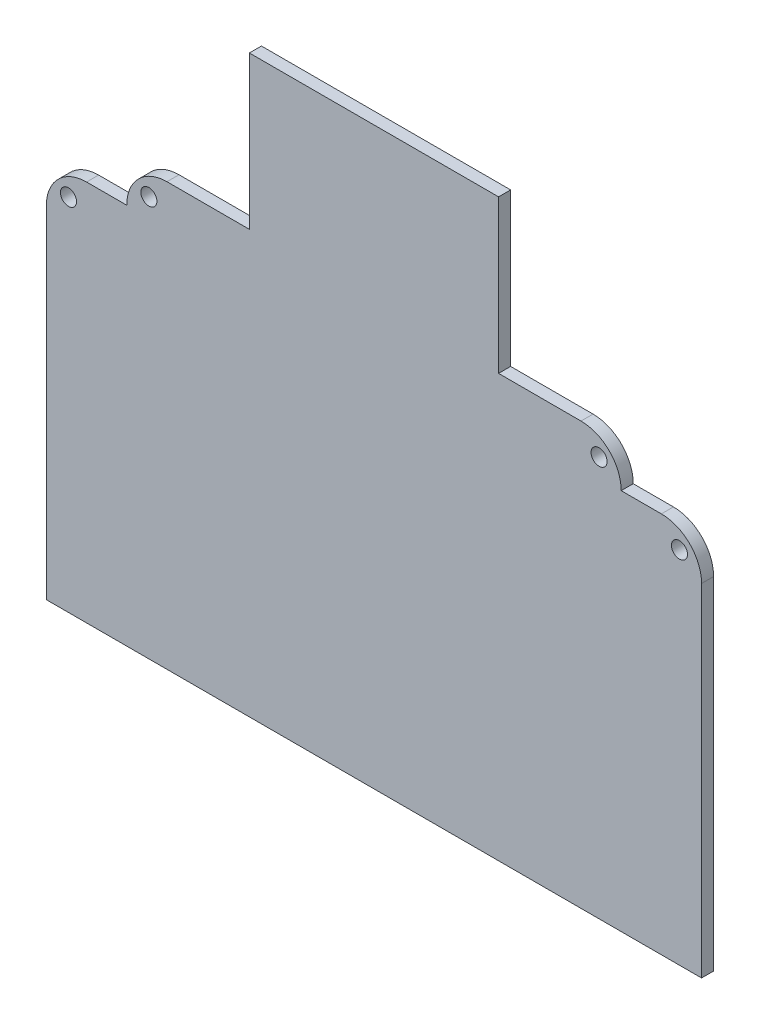
ISO-10303-21;
HEADER;
FILE_DESCRIPTION(('STEP AP214'),'2;1');
FILE_NAME('part.step','',(''),(''),'','','');
FILE_SCHEMA(('AUTOMOTIVE_DESIGN { 1 0 10303 214 1 1 1 1 }'));
ENDSEC;
DATA;
#1=APPLICATION_CONTEXT('core data for automotive mechanical design processes');
#2=APPLICATION_PROTOCOL_DEFINITION('international standard','automotive_design',2000,#1);
#3=PRODUCT_CONTEXT('',#1,'mechanical');
#4=PRODUCT('Part','Part','',(#3));
#5=PRODUCT_RELATED_PRODUCT_CATEGORY('part','',(#4));
#6=PRODUCT_DEFINITION_FORMATION('','',#4);
#7=PRODUCT_DEFINITION_CONTEXT('part definition',#1,'design');
#8=PRODUCT_DEFINITION('design','',#6,#7);
#9=PRODUCT_DEFINITION_SHAPE('','',#8);
#10=(LENGTH_UNIT() NAMED_UNIT(*) SI_UNIT(.MILLI.,.METRE.));
#11=(NAMED_UNIT(*) PLANE_ANGLE_UNIT() SI_UNIT($,.RADIAN.));
#12=(NAMED_UNIT(*) SI_UNIT($,.STERADIAN.) SOLID_ANGLE_UNIT());
#13=UNCERTAINTY_MEASURE_WITH_UNIT(LENGTH_MEASURE(1.E-05),#10,'distance_accuracy_value','');
#14=(GEOMETRIC_REPRESENTATION_CONTEXT(3) GLOBAL_UNCERTAINTY_ASSIGNED_CONTEXT((#13)) GLOBAL_UNIT_ASSIGNED_CONTEXT((#10,
#11,#12)) REPRESENTATION_CONTEXT('',''));
#15=CARTESIAN_POINT('',(0.,0.,0.));
#16=DIRECTION('',(0.,0.,1.));
#17=DIRECTION('',(1.,0.,0.));
#18=AXIS2_PLACEMENT_3D('',#15,#16,#17);
#19=CARTESIAN_POINT('',(-27.9951847515944,20.0587080209774,3.));
#20=DIRECTION('',(-0.00060027867075423,-0.999999819832742,0.));
#21=DIRECTION('',(0.999999819832743,-0.00060027867075423,0.));
#22=AXIS2_PLACEMENT_3D('',#19,#20,#21);
#23=PLANE('',#22);
#24=DIRECTION('',(-0.999999819832742,0.00060027867075423,0.));
#25=VECTOR('',#24,1.);
#26=CARTESIAN_POINT('',(-27.9951847515944,20.0587080209774,3.));
#27=LINE('',#26,#25);
#28=CARTESIAN_POINT('',(-7.49701113537413,20.0464034023493,3.));
#29=VERTEX_POINT('',#28);
#30=CARTESIAN_POINT('',(-27.9951847515944,20.0587080209774,3.));
#31=VERTEX_POINT('',#30);
#32=EDGE_CURVE('E50',#29,#31,#27,.T.);
#33=ORIENTED_EDGE('',*,*,#32,.F.);
#34=DIRECTION('',(0.,0.,1.));
#35=VECTOR('',#34,1.);
#36=CARTESIAN_POINT('',(-7.49701113537412,20.0464034023493,0.));
#37=LINE('',#36,#35);
#38=CARTESIAN_POINT('',(-7.49701113537412,20.0464034023493,0.));
#39=VERTEX_POINT('',#38);
#40=EDGE_CURVE('E204',#39,#29,#37,.T.);
#41=ORIENTED_EDGE('',*,*,#40,.F.);
#42=DIRECTION('',(-0.999999819832742,0.00060027867075423,0.));
#43=VECTOR('',#42,1.);
#44=CARTESIAN_POINT('',(-27.9951847515944,20.0587080209774,0.));
#45=LINE('',#44,#43);
#46=CARTESIAN_POINT('',(-27.9951847515944,20.0587080209774,0.));
#47=VERTEX_POINT('',#46);
#48=EDGE_CURVE('E259',#39,#47,#45,.T.);
#49=ORIENTED_EDGE('',*,*,#48,.T.);
#50=DIRECTION('',(0.,0.,-1.));
#51=VECTOR('',#50,1.);
#52=CARTESIAN_POINT('',(-27.9951847515944,20.0587080209774,3.));
#53=LINE('',#52,#51);
#54=EDGE_CURVE('E284',#31,#47,#53,.T.);
#55=ORIENTED_EDGE('',*,*,#54,.F.);
#56=EDGE_LOOP('',(#33,#41,#49,#55));
#57=FACE_BOUND('',#56,.T.);
#58=ADVANCED_FACE('F33',(#57),#23,.F.);
#59=CARTESIAN_POINT('',(-57.9970111353741,-0.00912238469951386,3.));
#60=DIRECTION('',(1.,0.,0.));
#61=DIRECTION('',(0.,0.,-1.));
#62=AXIS2_PLACEMENT_3D('',#59,#60,#61);
#63=PLANE('',#62);
#64=DIRECTION('',(0.,-1.,0.));
#65=VECTOR('',#64,1.);
#66=CARTESIAN_POINT('',(-57.9970111353741,-0.00912238469951386,0.));
#67=LINE('',#66,#65);
#68=CARTESIAN_POINT('',(-57.9970111353741,-0.00912238469951257,0.));
#69=VERTEX_POINT('',#68);
#70=CARTESIAN_POINT('',(-57.9970111353741,-85.0091223846995,0.));
#71=VERTEX_POINT('',#70);
#72=EDGE_CURVE('E157',#69,#71,#67,.T.);
#73=ORIENTED_EDGE('',*,*,#72,.T.);
#74=DIRECTION('',(0.,0.,1.));
#75=VECTOR('',#74,1.);
#76=CARTESIAN_POINT('',(-57.9970111353741,-85.0091223846995,0.));
#77=LINE('',#76,#75);
#78=CARTESIAN_POINT('',(-57.9970111353741,-85.0091223846995,3.));
#79=VERTEX_POINT('',#78);
#80=EDGE_CURVE('E160',#71,#79,#77,.T.);
#81=ORIENTED_EDGE('',*,*,#80,.T.);
#82=DIRECTION('',(0.,-1.,0.));
#83=VECTOR('',#82,1.);
#84=CARTESIAN_POINT('',(-57.9970111353741,-0.00912238469951386,3.));
#85=LINE('',#84,#83);
#86=CARTESIAN_POINT('',(-57.9970111353741,-0.00912238469951257,3.));
#87=VERTEX_POINT('',#86);
#88=EDGE_CURVE('E225',#87,#79,#85,.T.);
#89=ORIENTED_EDGE('',*,*,#88,.F.);
#90=DIRECTION('',(0.,0.,-1.));
#91=VECTOR('',#90,1.);
#92=CARTESIAN_POINT('',(-57.9970111353741,-0.00912238469951257,3.));
#93=LINE('',#92,#91);
#94=EDGE_CURVE('E163',#87,#69,#93,.T.);
#95=ORIENTED_EDGE('',*,*,#94,.T.);
#96=EDGE_LOOP('',(#73,#81,#89,#95));
#97=FACE_BOUND('',#96,.T.);
#98=ADVANCED_FACE('F35',(#97),#63,.F.);
#99=CARTESIAN_POINT('',(105.002988864626,-5.00912238469944,3.));
#100=DIRECTION('',(-1.,0.,0.));
#101=DIRECTION('',(0.,0.,1.));
#102=AXIS2_PLACEMENT_3D('',#99,#100,#101);
#103=PLANE('',#102);
#104=DIRECTION('',(0.,1.,0.));
#105=VECTOR('',#104,1.);
#106=CARTESIAN_POINT('',(105.002988864626,-5.00912238469944,0.));
#107=LINE('',#106,#105);
#108=CARTESIAN_POINT('',(105.002988864626,-85.0091223846995,0.));
#109=VERTEX_POINT('',#108);
#110=CARTESIAN_POINT('',(105.002988864626,-0.00912238469944447,0.));
#111=VERTEX_POINT('',#110);
#112=EDGE_CURVE('E167',#109,#111,#107,.T.);
#113=ORIENTED_EDGE('',*,*,#112,.T.);
#114=DIRECTION('',(0.,0.,-1.));
#115=VECTOR('',#114,1.);
#116=CARTESIAN_POINT('',(105.002988864626,-0.00912238469944447,3.));
#117=LINE('',#116,#115);
#118=CARTESIAN_POINT('',(105.002988864626,-0.00912238469944447,3.));
#119=VERTEX_POINT('',#118);
#120=EDGE_CURVE('E11',#119,#111,#117,.T.);
#121=ORIENTED_EDGE('',*,*,#120,.F.);
#122=DIRECTION('',(0.,1.,0.));
#123=VECTOR('',#122,1.);
#124=CARTESIAN_POINT('',(105.002988864626,-5.00912238469944,3.));
#125=LINE('',#124,#123);
#126=CARTESIAN_POINT('',(105.002988864626,-85.0091223846995,3.));
#127=VERTEX_POINT('',#126);
#128=EDGE_CURVE('E227',#127,#119,#125,.T.);
#129=ORIENTED_EDGE('',*,*,#128,.F.);
#130=DIRECTION('',(0.,0.,1.));
#131=VECTOR('',#130,1.);
#132=CARTESIAN_POINT('',(105.002988864626,-85.0091223846995,0.));
#133=LINE('',#132,#131);
#134=EDGE_CURVE('E177',#109,#127,#133,.T.);
#135=ORIENTED_EDGE('',*,*,#134,.F.);
#136=EDGE_LOOP('',(#113,#121,#129,#135));
#137=FACE_BOUND('',#136,.T.);
#138=ADVANCED_FACE('F330',(#137),#103,.F.);
#139=CARTESIAN_POINT('',(95.0029888646259,-0.00912238469944447,3.));
#140=DIRECTION('',(0.,0.,-1.));
#141=DIRECTION('',(-1.,0.,0.));
#142=AXIS2_PLACEMENT_3D('',#139,#140,#141);
#143=CYLINDRICAL_SURFACE('',#142,10.);
#144=CARTESIAN_POINT('',(95.0029888646259,-0.00912238469944447,0.));
#145=DIRECTION('',(0.,0.,1.));
#146=DIRECTION('',(1.,0.,0.));
#147=AXIS2_PLACEMENT_3D('',#144,#145,#146);
#148=CIRCLE('',#147,10.);
#149=CARTESIAN_POINT('',(95.0029888646259,9.99087761530055,0.));
#150=VERTEX_POINT('',#149);
#151=EDGE_CURVE('E251',#111,#150,#148,.T.);
#152=ORIENTED_EDGE('',*,*,#151,.T.);
#153=DIRECTION('',(0.,0.,-1.));
#154=VECTOR('',#153,1.);
#155=CARTESIAN_POINT('',(95.0029888646259,9.99087761530055,3.));
#156=LINE('',#155,#154);
#157=CARTESIAN_POINT('',(95.0029888646259,9.99087761530055,3.));
#158=VERTEX_POINT('',#157);
#159=EDGE_CURVE('E42',#158,#150,#156,.T.);
#160=ORIENTED_EDGE('',*,*,#159,.F.);
#161=CARTESIAN_POINT('',(95.0029888646259,-0.00912238469944447,3.));
#162=DIRECTION('',(0.,0.,1.));
#163=DIRECTION('',(1.,0.,0.));
#164=AXIS2_PLACEMENT_3D('',#161,#162,#163);
#165=CIRCLE('',#164,10.);
#166=EDGE_CURVE('E230',#119,#158,#165,.T.);
#167=ORIENTED_EDGE('',*,*,#166,.F.);
#168=ORIENTED_EDGE('',*,*,#120,.T.);
#169=EDGE_LOOP('',(#152,#160,#167,#168));
#170=FACE_BOUND('',#169,.T.);
#171=ADVANCED_FACE('F372',(#170),#143,.T.);
#172=CARTESIAN_POINT('',(95.0029888646259,9.99087761530056,3.));
#173=DIRECTION('',(0.,-1.,0.));
#174=DIRECTION('',(1.,0.,0.));
#175=AXIS2_PLACEMENT_3D('',#172,#173,#174);
#176=PLANE('',#175);
#177=DIRECTION('',(-1.,0.,0.));
#178=VECTOR('',#177,1.);
#179=CARTESIAN_POINT('',(95.0029888646259,9.99087761530056,0.));
#180=LINE('',#179,#178);
#181=CARTESIAN_POINT('',(85.0029888646259,9.99087761530055,0.));
#182=VERTEX_POINT('',#181);
#183=EDGE_CURVE('E253',#150,#182,#180,.T.);
#184=ORIENTED_EDGE('',*,*,#183,.T.);
#185=DIRECTION('',(0.,0.,-1.));
#186=VECTOR('',#185,1.);
#187=CARTESIAN_POINT('',(85.0029888646259,9.99087761530055,3.));
#188=LINE('',#187,#186);
#189=CARTESIAN_POINT('',(85.0029888646259,9.99087761530055,3.));
#190=VERTEX_POINT('',#189);
#191=EDGE_CURVE('E293',#190,#182,#188,.T.);
#192=ORIENTED_EDGE('',*,*,#191,.F.);
#193=DIRECTION('',(-1.,0.,0.));
#194=VECTOR('',#193,1.);
#195=CARTESIAN_POINT('',(95.0029888646259,9.99087761530056,3.));
#196=LINE('',#195,#194);
#197=EDGE_CURVE('E232',#158,#190,#196,.T.);
#198=ORIENTED_EDGE('',*,*,#197,.F.);
#199=ORIENTED_EDGE('',*,*,#159,.T.);
#200=EDGE_LOOP('',(#184,#192,#198,#199));
#201=FACE_BOUND('',#200,.T.);
#202=ADVANCED_FACE('F368',(#201),#176,.F.);
#203=CARTESIAN_POINT('',(85.0029888646259,9.99687860141664,3.));
#204=DIRECTION('',(-1.,0.,0.));
#205=DIRECTION('',(0.,0.,1.));
#206=AXIS2_PLACEMENT_3D('',#203,#204,#205);
#207=PLANE('',#206);
#208=DIRECTION('',(0.,1.,0.));
#209=VECTOR('',#208,1.);
#210=CARTESIAN_POINT('',(85.0029888646259,9.99687860141664,0.));
#211=LINE('',#210,#209);
#212=CARTESIAN_POINT('',(85.0029888646259,9.99687860141664,0.));
#213=VERTEX_POINT('',#212);
#214=EDGE_CURVE('E255',#182,#213,#211,.T.);
#215=ORIENTED_EDGE('',*,*,#214,.T.);
#216=DIRECTION('',(0.,0.,-1.));
#217=VECTOR('',#216,1.);
#218=CARTESIAN_POINT('',(85.0029888646259,9.99687860141664,3.));
#219=LINE('',#218,#217);
#220=CARTESIAN_POINT('',(85.0029888646259,9.99687860141664,3.));
#221=VERTEX_POINT('',#220);
#222=EDGE_CURVE('E290',#221,#213,#219,.T.);
#223=ORIENTED_EDGE('',*,*,#222,.F.);
#224=DIRECTION('',(0.,1.,0.));
#225=VECTOR('',#224,1.);
#226=CARTESIAN_POINT('',(85.0029888646259,9.99687860141664,3.));
#227=LINE('',#226,#225);
#228=EDGE_CURVE('E234',#190,#221,#227,.T.);
#229=ORIENTED_EDGE('',*,*,#228,.F.);
#230=ORIENTED_EDGE('',*,*,#191,.T.);
#231=EDGE_LOOP('',(#215,#223,#229,#230));
#232=FACE_BOUND('',#231,.T.);
#233=ADVANCED_FACE('F342',(#232),#207,.F.);
#234=CARTESIAN_POINT('',(75.0029888646259,9.99687860141671,3.));
#235=DIRECTION('',(0.,0.,-1.));
#236=DIRECTION('',(-1.,0.,0.));
#237=AXIS2_PLACEMENT_3D('',#234,#235,#236);
#238=CYLINDRICAL_SURFACE('',#237,10.);
#239=CARTESIAN_POINT('',(75.0029888646259,9.99687860141671,0.));
#240=DIRECTION('',(0.,0.,1.));
#241=DIRECTION('',(-1.,0.,0.));
#242=AXIS2_PLACEMENT_3D('',#239,#240,#241);
#243=CIRCLE('',#242,10.);
#244=CARTESIAN_POINT('',(75.0089916513333,19.9968767997441,0.));
#245=VERTEX_POINT('',#244);
#246=EDGE_CURVE('E257',#213,#245,#243,.T.);
#247=ORIENTED_EDGE('',*,*,#246,.T.);
#248=DIRECTION('',(0.,0.,-1.));
#249=VECTOR('',#248,1.);
#250=CARTESIAN_POINT('',(75.0089916513333,19.9968767997441,3.));
#251=LINE('',#250,#249);
#252=CARTESIAN_POINT('',(75.0089916513333,19.9968767997441,3.));
#253=VERTEX_POINT('',#252);
#254=EDGE_CURVE('E287',#253,#245,#251,.T.);
#255=ORIENTED_EDGE('',*,*,#254,.F.);
#256=CARTESIAN_POINT('',(75.0029888646259,9.99687860141671,3.));
#257=DIRECTION('',(0.,0.,1.));
#258=DIRECTION('',(-1.,0.,0.));
#259=AXIS2_PLACEMENT_3D('',#256,#257,#258);
#260=CIRCLE('',#259,10.);
#261=EDGE_CURVE('E236',#221,#253,#260,.T.);
#262=ORIENTED_EDGE('',*,*,#261,.F.);
#263=ORIENTED_EDGE('',*,*,#222,.T.);
#264=EDGE_LOOP('',(#247,#255,#262,#263));
#265=FACE_BOUND('',#264,.T.);
#266=ADVANCED_FACE('F334',(#265),#238,.T.);
#267=CARTESIAN_POINT('',(54.5029888646259,20.0091861180572,0.));
#268=VERTEX_POINT('',#267);
#269=EDGE_CURVE('E260',#245,#268,#45,.T.);
#270=ORIENTED_EDGE('',*,*,#269,.T.);
#271=DIRECTION('',(0.,0.,1.));
#272=VECTOR('',#271,1.);
#273=CARTESIAN_POINT('',(54.5029888646259,20.0091861180572,0.));
#274=LINE('',#273,#272);
#275=CARTESIAN_POINT('',(54.5029888646259,20.0091861180572,3.));
#276=VERTEX_POINT('',#275);
#277=EDGE_CURVE('E58',#268,#276,#274,.T.);
#278=ORIENTED_EDGE('',*,*,#277,.T.);
#279=EDGE_CURVE('E238',#253,#276,#27,.T.);
#280=ORIENTED_EDGE('',*,*,#279,.F.);
#281=ORIENTED_EDGE('',*,*,#254,.T.);
#282=EDGE_LOOP('',(#270,#278,#280,#281));
#283=FACE_BOUND('',#282,.T.);
#284=ADVANCED_FACE('F324',(#283),#23,.F.);
#285=CARTESIAN_POINT('',(-27.9951847515944,20.0587080209774,3.));
#286=DIRECTION('',(0.,-1.,0.));
#287=DIRECTION('',(0.,0.,-1.));
#288=AXIS2_PLACEMENT_3D('',#285,#286,#287);
#289=PLANE('',#288);
#290=DIRECTION('',(-1.,0.,0.));
#291=VECTOR('',#290,1.);
#292=CARTESIAN_POINT('',(-27.9951847515944,20.0587080209774,0.));
#293=LINE('',#292,#291);
#294=CARTESIAN_POINT('',(-27.9970111353741,20.0587080209774,0.));
#295=VERTEX_POINT('',#294);
#296=EDGE_CURVE('E262',#47,#295,#293,.T.);
#297=ORIENTED_EDGE('',*,*,#296,.T.);
#298=DIRECTION('',(0.,0.,-1.));
#299=VECTOR('',#298,1.);
#300=CARTESIAN_POINT('',(-27.9970111353741,20.0587080209774,3.));
#301=LINE('',#300,#299);
#302=CARTESIAN_POINT('',(-27.9970111353741,20.0587080209774,3.));
#303=VERTEX_POINT('',#302);
#304=EDGE_CURVE('E281',#303,#295,#301,.T.);
#305=ORIENTED_EDGE('',*,*,#304,.F.);
#306=DIRECTION('',(-1.,0.,0.));
#307=VECTOR('',#306,1.);
#308=CARTESIAN_POINT('',(-27.9951847515944,20.0587080209774,3.));
#309=LINE('',#308,#307);
#310=EDGE_CURVE('E240',#31,#303,#309,.T.);
#311=ORIENTED_EDGE('',*,*,#310,.F.);
#312=ORIENTED_EDGE('',*,*,#54,.T.);
#313=EDGE_LOOP('',(#297,#305,#311,#312));
#314=FACE_BOUND('',#313,.T.);
#315=ADVANCED_FACE('F333',(#314),#289,.F.);
#316=CARTESIAN_POINT('',(-27.9970111353741,10.0587080209774,3.));
#317=DIRECTION('',(0.,0.,-1.));
#318=DIRECTION('',(-1.,0.,0.));
#319=AXIS2_PLACEMENT_3D('',#316,#317,#318);
#320=CYLINDRICAL_SURFACE('',#319,10.);
#321=CARTESIAN_POINT('',(-27.9970111353741,10.0587080209774,0.));
#322=DIRECTION('',(0.,0.,1.));
#323=DIRECTION('',(1.,0.,0.));
#324=AXIS2_PLACEMENT_3D('',#321,#322,#323);
#325=CIRCLE('',#324,10.);
#326=CARTESIAN_POINT('',(-37.9970111353741,10.0587080209773,0.));
#327=VERTEX_POINT('',#326);
#328=EDGE_CURVE('E264',#295,#327,#325,.T.);
#329=ORIENTED_EDGE('',*,*,#328,.T.);
#330=DIRECTION('',(0.,0.,-1.));
#331=VECTOR('',#330,1.);
#332=CARTESIAN_POINT('',(-37.9970111353741,10.0587080209773,3.));
#333=LINE('',#332,#331);
#334=CARTESIAN_POINT('',(-37.9970111353741,10.0587080209773,3.));
#335=VERTEX_POINT('',#334);
#336=EDGE_CURVE('E278',#335,#327,#333,.T.);
#337=ORIENTED_EDGE('',*,*,#336,.F.);
#338=CARTESIAN_POINT('',(-27.9970111353741,10.0587080209774,3.));
#339=DIRECTION('',(0.,0.,1.));
#340=DIRECTION('',(1.,0.,0.));
#341=AXIS2_PLACEMENT_3D('',#338,#339,#340);
#342=CIRCLE('',#341,10.);
#343=EDGE_CURVE('E242',#303,#335,#342,.T.);
#344=ORIENTED_EDGE('',*,*,#343,.F.);
#345=ORIENTED_EDGE('',*,*,#304,.T.);
#346=EDGE_LOOP('',(#329,#337,#344,#345));
#347=FACE_BOUND('',#346,.T.);
#348=ADVANCED_FACE('F339',(#347),#320,.T.);
#349=CARTESIAN_POINT('',(-37.9970111353741,10.0587080209773,3.));
#350=DIRECTION('',(1.,0.,0.));
#351=DIRECTION('',(0.,0.,-1.));
#352=AXIS2_PLACEMENT_3D('',#349,#350,#351);
#353=PLANE('',#352);
#354=DIRECTION('',(0.,-1.,0.));
#355=VECTOR('',#354,1.);
#356=CARTESIAN_POINT('',(-37.9970111353741,10.0587080209773,0.));
#357=LINE('',#356,#355);
#358=CARTESIAN_POINT('',(-37.9970111353741,9.99087761530056,0.));
#359=VERTEX_POINT('',#358);
#360=EDGE_CURVE('E266',#327,#359,#357,.T.);
#361=ORIENTED_EDGE('',*,*,#360,.T.);
#362=DIRECTION('',(0.,0.,-1.));
#363=VECTOR('',#362,1.);
#364=CARTESIAN_POINT('',(-37.9970111353741,9.99087761530056,3.));
#365=LINE('',#364,#363);
#366=CARTESIAN_POINT('',(-37.9970111353741,9.99087761530056,3.));
#367=VERTEX_POINT('',#366);
#368=EDGE_CURVE('E275',#367,#359,#365,.T.);
#369=ORIENTED_EDGE('',*,*,#368,.F.);
#370=DIRECTION('',(0.,-1.,0.));
#371=VECTOR('',#370,1.);
#372=CARTESIAN_POINT('',(-37.9970111353741,10.0587080209773,3.));
#373=LINE('',#372,#371);
#374=EDGE_CURVE('E244',#335,#367,#373,.T.);
#375=ORIENTED_EDGE('',*,*,#374,.F.);
#376=ORIENTED_EDGE('',*,*,#336,.T.);
#377=EDGE_LOOP('',(#361,#369,#375,#376));
#378=FACE_BOUND('',#377,.T.);
#379=ADVANCED_FACE('F388',(#378),#353,.F.);
#380=CARTESIAN_POINT('',(-37.9970111353741,9.99087761530056,3.));
#381=DIRECTION('',(0.,-1.,0.));
#382=DIRECTION('',(1.,0.,0.));
#383=AXIS2_PLACEMENT_3D('',#380,#381,#382);
#384=PLANE('',#383);
#385=DIRECTION('',(-1.,0.,0.));
#386=VECTOR('',#385,1.);
#387=CARTESIAN_POINT('',(-37.9970111353741,9.99087761530056,0.));
#388=LINE('',#387,#386);
#389=CARTESIAN_POINT('',(-47.9970111353741,9.99087761530056,0.));
#390=VERTEX_POINT('',#389);
#391=EDGE_CURVE('E268',#359,#390,#388,.T.);
#392=ORIENTED_EDGE('',*,*,#391,.T.);
#393=DIRECTION('',(0.,0.,-1.));
#394=VECTOR('',#393,1.);
#395=CARTESIAN_POINT('',(-47.9970111353741,9.99087761530056,3.));
#396=LINE('',#395,#394);
#397=CARTESIAN_POINT('',(-47.9970111353741,9.99087761530056,3.));
#398=VERTEX_POINT('',#397);
#399=EDGE_CURVE('E272',#398,#390,#396,.T.);
#400=ORIENTED_EDGE('',*,*,#399,.F.);
#401=DIRECTION('',(-1.,0.,0.));
#402=VECTOR('',#401,1.);
#403=CARTESIAN_POINT('',(-37.9970111353741,9.99087761530056,3.));
#404=LINE('',#403,#402);
#405=EDGE_CURVE('E246',#367,#398,#404,.T.);
#406=ORIENTED_EDGE('',*,*,#405,.F.);
#407=ORIENTED_EDGE('',*,*,#368,.T.);
#408=EDGE_LOOP('',(#392,#400,#406,#407));
#409=FACE_BOUND('',#408,.T.);
#410=ADVANCED_FACE('F384',(#409),#384,.F.);
#411=CARTESIAN_POINT('',(-47.9970111353741,-0.00912238469944274,3.));
#412=DIRECTION('',(0.,0.,-1.));
#413=DIRECTION('',(-1.,0.,0.));
#414=AXIS2_PLACEMENT_3D('',#411,#412,#413);
#415=CYLINDRICAL_SURFACE('',#414,10.);
#416=CARTESIAN_POINT('',(-47.9970111353741,-0.00912238469944274,0.));
#417=DIRECTION('',(0.,0.,1.));
#418=DIRECTION('',(1.,0.,0.));
#419=AXIS2_PLACEMENT_3D('',#416,#417,#418);
#420=CIRCLE('',#419,10.);
#421=EDGE_CURVE('E228',#390,#69,#420,.T.);
#422=ORIENTED_EDGE('',*,*,#421,.T.);
#423=ORIENTED_EDGE('',*,*,#94,.F.);
#424=CARTESIAN_POINT('',(-47.9970111353741,-0.00912238469944274,3.));
#425=DIRECTION('',(0.,0.,1.));
#426=DIRECTION('',(1.,0.,0.));
#427=AXIS2_PLACEMENT_3D('',#424,#425,#426);
#428=CIRCLE('',#427,10.);
#429=EDGE_CURVE('E248',#398,#87,#428,.T.);
#430=ORIENTED_EDGE('',*,*,#429,.F.);
#431=ORIENTED_EDGE('',*,*,#399,.T.);
#432=EDGE_LOOP('',(#422,#423,#430,#431));
#433=FACE_BOUND('',#432,.T.);
#434=ADVANCED_FACE('F379',(#433),#415,.T.);
#435=CARTESIAN_POINT('',(95.0029888646259,-0.00912238469944447,3.));
#436=DIRECTION('',(0.,0.,1.));
#437=DIRECTION('',(1.,0.,0.));
#438=AXIS2_PLACEMENT_3D('',#435,#436,#437);
#439=PLANE('',#438);
#440=CARTESIAN_POINT('',(-52.4970111353741,4.49087761530056,3.));
#441=DIRECTION('',(0.,0.,1.));
#442=DIRECTION('',(1.,0.,0.));
#443=AXIS2_PLACEMENT_3D('',#440,#441,#442);
#444=CIRCLE('',#443,2.);
#445=CARTESIAN_POINT('',(-50.4970111353741,4.49087761530056,3.));
#446=VERTEX_POINT('',#445);
#447=EDGE_CURVE('E206',#446,#446,#444,.T.);
#448=ORIENTED_EDGE('',*,*,#447,.F.);
#449=EDGE_LOOP('',(#448));
#450=FACE_BOUND('',#449,.T.);
#451=CARTESIAN_POINT('',(99.5029888646259,4.49087761530055,3.));
#452=DIRECTION('',(0.,0.,1.));
#453=DIRECTION('',(1.,0.,0.));
#454=AXIS2_PLACEMENT_3D('',#451,#452,#453);
#455=CIRCLE('',#454,2.);
#456=CARTESIAN_POINT('',(101.502988864626,4.49087761530055,3.));
#457=VERTEX_POINT('',#456);
#458=EDGE_CURVE('E214',#457,#457,#455,.T.);
#459=ORIENTED_EDGE('',*,*,#458,.F.);
#460=EDGE_LOOP('',(#459));
#461=FACE_BOUND('',#460,.T.);
#462=CARTESIAN_POINT('',(79.5029888646259,14.4941781576644,3.));
#463=DIRECTION('',(0.,0.,1.));
#464=DIRECTION('',(1.,0.,0.));
#465=AXIS2_PLACEMENT_3D('',#462,#463,#464);
#466=CIRCLE('',#465,2.);
#467=CARTESIAN_POINT('',(81.5029888646259,14.4941781576644,3.));
#468=VERTEX_POINT('',#467);
#469=EDGE_CURVE('E218',#468,#468,#466,.T.);
#470=ORIENTED_EDGE('',*,*,#469,.F.);
#471=EDGE_LOOP('',(#470));
#472=FACE_BOUND('',#471,.T.);
#473=CARTESIAN_POINT('',(-32.4970111353741,14.5587080209774,3.));
#474=DIRECTION('',(0.,0.,1.));
#475=DIRECTION('',(1.,0.,0.));
#476=AXIS2_PLACEMENT_3D('',#473,#474,#475);
#477=CIRCLE('',#476,2.);
#478=CARTESIAN_POINT('',(-30.4970111353741,14.5587080209774,3.));
#479=VERTEX_POINT('',#478);
#480=EDGE_CURVE('E222',#479,#479,#477,.T.);
#481=ORIENTED_EDGE('',*,*,#480,.F.);
#482=EDGE_LOOP('',(#481));
#483=FACE_BOUND('',#482,.T.);
#484=ORIENTED_EDGE('',*,*,#88,.T.);
#485=DIRECTION('',(1.,0.,0.));
#486=VECTOR('',#485,1.);
#487=CARTESIAN_POINT('',(-57.9970111353741,-85.0091223846995,3.));
#488=LINE('',#487,#486);
#489=EDGE_CURVE('E176',#79,#127,#488,.T.);
#490=ORIENTED_EDGE('',*,*,#489,.T.);
#491=ORIENTED_EDGE('',*,*,#128,.T.);
#492=ORIENTED_EDGE('',*,*,#166,.T.);
#493=ORIENTED_EDGE('',*,*,#197,.T.);
#494=ORIENTED_EDGE('',*,*,#228,.T.);
#495=ORIENTED_EDGE('',*,*,#261,.T.);
#496=ORIENTED_EDGE('',*,*,#279,.T.);
#497=DIRECTION('',(0.,1.,0.));
#498=VECTOR('',#497,1.);
#499=CARTESIAN_POINT('',(54.5029888646259,58.0464034023493,3.));
#500=LINE('',#499,#498);
#501=CARTESIAN_POINT('',(54.5029888646259,58.0464034023493,3.));
#502=VERTEX_POINT('',#501);
#503=EDGE_CURVE('E185',#276,#502,#500,.T.);
#504=ORIENTED_EDGE('',*,*,#503,.T.);
#505=DIRECTION('',(-1.,0.,0.));
#506=VECTOR('',#505,1.);
#507=CARTESIAN_POINT('',(-7.49701113537412,58.0464034023493,3.));
#508=LINE('',#507,#506);
#509=CARTESIAN_POINT('',(-7.49701113537412,58.0464034023493,3.));
#510=VERTEX_POINT('',#509);
#511=EDGE_CURVE('E199',#502,#510,#508,.T.);
#512=ORIENTED_EDGE('',*,*,#511,.T.);
#513=DIRECTION('',(0.,-1.,0.));
#514=VECTOR('',#513,1.);
#515=CARTESIAN_POINT('',(-7.49701113537412,20.0464034023493,3.));
#516=LINE('',#515,#514);
#517=EDGE_CURVE('E191',#510,#29,#516,.T.);
#518=ORIENTED_EDGE('',*,*,#517,.T.);
#519=ORIENTED_EDGE('',*,*,#32,.T.);
#520=ORIENTED_EDGE('',*,*,#310,.T.);
#521=ORIENTED_EDGE('',*,*,#343,.T.);
#522=ORIENTED_EDGE('',*,*,#374,.T.);
#523=ORIENTED_EDGE('',*,*,#405,.T.);
#524=ORIENTED_EDGE('',*,*,#429,.T.);
#525=EDGE_LOOP('',(#484,#490,#491,#492,#493,#494,#495,#496,#504,#512,#518,#519,#520,#521,#522,
#523,#524));
#526=FACE_BOUND('',#525,.T.);
#527=ADVANCED_FACE('F358',(#450,#461,#472,#483,#526),#439,.T.);
#528=CARTESIAN_POINT('',(95.0029888646259,-0.00912238469944447,0.));
#529=DIRECTION('',(0.,0.,1.));
#530=DIRECTION('',(1.,0.,0.));
#531=AXIS2_PLACEMENT_3D('',#528,#529,#530);
#532=PLANE('',#531);
#533=CARTESIAN_POINT('',(-52.4970111353741,4.49087761530056,0.));
#534=DIRECTION('',(0.,0.,1.));
#535=DIRECTION('',(1.,0.,0.));
#536=AXIS2_PLACEMENT_3D('',#533,#534,#535);
#537=CIRCLE('',#536,2.);
#538=CARTESIAN_POINT('',(-50.4970111353741,4.49087761530056,0.));
#539=VERTEX_POINT('',#538);
#540=EDGE_CURVE('E37',#539,#539,#537,.T.);
#541=ORIENTED_EDGE('',*,*,#540,.T.);
#542=EDGE_LOOP('',(#541));
#543=FACE_BOUND('',#542,.T.);
#544=CARTESIAN_POINT('',(99.5029888646259,4.49087761530055,0.));
#545=DIRECTION('',(0.,0.,1.));
#546=DIRECTION('',(1.,0.,0.));
#547=AXIS2_PLACEMENT_3D('',#544,#545,#546);
#548=CIRCLE('',#547,2.);
#549=CARTESIAN_POINT('',(101.502988864626,4.49087761530055,0.));
#550=VERTEX_POINT('',#549);
#551=EDGE_CURVE('E217',#550,#550,#548,.T.);
#552=ORIENTED_EDGE('',*,*,#551,.T.);
#553=EDGE_LOOP('',(#552));
#554=FACE_BOUND('',#553,.T.);
#555=CARTESIAN_POINT('',(79.5029888646259,14.4941781576644,0.));
#556=DIRECTION('',(0.,0.,1.));
#557=DIRECTION('',(1.,0.,0.));
#558=AXIS2_PLACEMENT_3D('',#555,#556,#557);
#559=CIRCLE('',#558,2.);
#560=CARTESIAN_POINT('',(81.5029888646259,14.4941781576644,0.));
#561=VERTEX_POINT('',#560);
#562=EDGE_CURVE('E221',#561,#561,#559,.T.);
#563=ORIENTED_EDGE('',*,*,#562,.T.);
#564=EDGE_LOOP('',(#563));
#565=FACE_BOUND('',#564,.T.);
#566=CARTESIAN_POINT('',(-32.4970111353741,14.5587080209774,0.));
#567=DIRECTION('',(0.,0.,1.));
#568=DIRECTION('',(1.,0.,0.));
#569=AXIS2_PLACEMENT_3D('',#566,#567,#568);
#570=CIRCLE('',#569,2.);
#571=CARTESIAN_POINT('',(-30.4970111353741,14.5587080209774,0.));
#572=VERTEX_POINT('',#571);
#573=EDGE_CURVE('E168',#572,#572,#570,.T.);
#574=ORIENTED_EDGE('',*,*,#573,.T.);
#575=EDGE_LOOP('',(#574));
#576=FACE_BOUND('',#575,.T.);
#577=ORIENTED_EDGE('',*,*,#72,.F.);
#578=ORIENTED_EDGE('',*,*,#421,.F.);
#579=ORIENTED_EDGE('',*,*,#391,.F.);
#580=ORIENTED_EDGE('',*,*,#360,.F.);
#581=ORIENTED_EDGE('',*,*,#328,.F.);
#582=ORIENTED_EDGE('',*,*,#296,.F.);
#583=ORIENTED_EDGE('',*,*,#48,.F.);
#584=DIRECTION('',(0.,-1.,0.));
#585=VECTOR('',#584,1.);
#586=CARTESIAN_POINT('',(-7.49701113537412,20.0464034023493,0.));
#587=LINE('',#586,#585);
#588=CARTESIAN_POINT('',(-7.49701113537412,58.0464034023493,0.));
#589=VERTEX_POINT('',#588);
#590=EDGE_CURVE('E194',#589,#39,#587,.T.);
#591=ORIENTED_EDGE('',*,*,#590,.F.);
#592=DIRECTION('',(-1.,0.,0.));
#593=VECTOR('',#592,1.);
#594=CARTESIAN_POINT('',(-7.49701113537412,58.0464034023493,0.));
#595=LINE('',#594,#593);
#596=CARTESIAN_POINT('',(54.5029888646259,58.0464034023493,0.));
#597=VERTEX_POINT('',#596);
#598=EDGE_CURVE('E190',#597,#589,#595,.T.);
#599=ORIENTED_EDGE('',*,*,#598,.F.);
#600=DIRECTION('',(0.,1.,0.));
#601=VECTOR('',#600,1.);
#602=CARTESIAN_POINT('',(54.5029888646259,58.0464034023493,0.));
#603=LINE('',#602,#601);
#604=EDGE_CURVE('E187',#268,#597,#603,.T.);
#605=ORIENTED_EDGE('',*,*,#604,.F.);
#606=ORIENTED_EDGE('',*,*,#269,.F.);
#607=ORIENTED_EDGE('',*,*,#246,.F.);
#608=ORIENTED_EDGE('',*,*,#214,.F.);
#609=ORIENTED_EDGE('',*,*,#183,.F.);
#610=ORIENTED_EDGE('',*,*,#151,.F.);
#611=ORIENTED_EDGE('',*,*,#112,.F.);
#612=DIRECTION('',(1.,0.,0.));
#613=VECTOR('',#612,1.);
#614=CARTESIAN_POINT('',(-57.9970111353741,-85.0091223846995,0.));
#615=LINE('',#614,#613);
#616=EDGE_CURVE('E174',#71,#109,#615,.T.);
#617=ORIENTED_EDGE('',*,*,#616,.F.);
#618=EDGE_LOOP('',(#577,#578,#579,#580,#581,#582,#583,#591,#599,#605,#606,#607,#608,#609,#610,
#611,#617));
#619=FACE_BOUND('',#618,.T.);
#620=ADVANCED_FACE('F179',(#543,#554,#565,#576,#619),#532,.F.);
#621=CARTESIAN_POINT('',(-32.4970111353741,14.5587080209774,-7.));
#622=DIRECTION('',(0.,0.,1.));
#623=DIRECTION('',(1.,0.,0.));
#624=AXIS2_PLACEMENT_3D('',#621,#622,#623);
#625=CYLINDRICAL_SURFACE('',#624,2.);
#626=ORIENTED_EDGE('',*,*,#480,.T.);
#627=EDGE_LOOP('',(#626));
#628=FACE_BOUND('',#627,.T.);
#629=ORIENTED_EDGE('',*,*,#573,.F.);
#630=EDGE_LOOP('',(#629));
#631=FACE_BOUND('',#630,.T.);
#632=ADVANCED_FACE('F319',(#628,#631),#625,.F.);
#633=CARTESIAN_POINT('',(79.5029888646259,14.4941781576644,-7.));
#634=DIRECTION('',(0.,0.,1.));
#635=DIRECTION('',(1.,0.,0.));
#636=AXIS2_PLACEMENT_3D('',#633,#634,#635);
#637=CYLINDRICAL_SURFACE('',#636,2.);
#638=ORIENTED_EDGE('',*,*,#469,.T.);
#639=EDGE_LOOP('',(#638));
#640=FACE_BOUND('',#639,.T.);
#641=ORIENTED_EDGE('',*,*,#562,.F.);
#642=EDGE_LOOP('',(#641));
#643=FACE_BOUND('',#642,.T.);
#644=ADVANCED_FACE('F309',(#640,#643),#637,.F.);
#645=CARTESIAN_POINT('',(99.5029888646259,4.49087761530055,-7.));
#646=DIRECTION('',(0.,0.,1.));
#647=DIRECTION('',(1.,0.,0.));
#648=AXIS2_PLACEMENT_3D('',#645,#646,#647);
#649=CYLINDRICAL_SURFACE('',#648,2.);
#650=ORIENTED_EDGE('',*,*,#458,.T.);
#651=EDGE_LOOP('',(#650));
#652=FACE_BOUND('',#651,.T.);
#653=ORIENTED_EDGE('',*,*,#551,.F.);
#654=EDGE_LOOP('',(#653));
#655=FACE_BOUND('',#654,.T.);
#656=ADVANCED_FACE('F306',(#652,#655),#649,.F.);
#657=CARTESIAN_POINT('',(-52.4970111353741,4.49087761530056,-7.));
#658=DIRECTION('',(0.,0.,1.));
#659=DIRECTION('',(1.,0.,0.));
#660=AXIS2_PLACEMENT_3D('',#657,#658,#659);
#661=CYLINDRICAL_SURFACE('',#660,2.);
#662=ORIENTED_EDGE('',*,*,#447,.T.);
#663=EDGE_LOOP('',(#662));
#664=FACE_BOUND('',#663,.T.);
#665=ORIENTED_EDGE('',*,*,#540,.F.);
#666=EDGE_LOOP('',(#665));
#667=FACE_BOUND('',#666,.T.);
#668=ADVANCED_FACE('F308',(#664,#667),#661,.F.);
#669=CARTESIAN_POINT('',(-7.49701113537412,20.0464034023493,0.));
#670=DIRECTION('',(-1.,0.,0.));
#671=DIRECTION('',(0.,0.,1.));
#672=AXIS2_PLACEMENT_3D('',#669,#670,#671);
#673=PLANE('',#672);
#674=ORIENTED_EDGE('',*,*,#517,.F.);
#675=DIRECTION('',(0.,0.,1.));
#676=VECTOR('',#675,1.);
#677=CARTESIAN_POINT('',(-7.49701113537412,58.0464034023493,0.));
#678=LINE('',#677,#676);
#679=EDGE_CURVE('E207',#589,#510,#678,.T.);
#680=ORIENTED_EDGE('',*,*,#679,.F.);
#681=ORIENTED_EDGE('',*,*,#590,.T.);
#682=ORIENTED_EDGE('',*,*,#40,.T.);
#683=EDGE_LOOP('',(#674,#680,#681,#682));
#684=FACE_BOUND('',#683,.T.);
#685=ADVANCED_FACE('F316',(#684),#673,.T.);
#686=CARTESIAN_POINT('',(-7.49701113537412,58.0464034023493,0.));
#687=DIRECTION('',(0.,1.,0.));
#688=DIRECTION('',(0.,0.,1.));
#689=AXIS2_PLACEMENT_3D('',#686,#687,#688);
#690=PLANE('',#689);
#691=ORIENTED_EDGE('',*,*,#511,.F.);
#692=DIRECTION('',(0.,0.,1.));
#693=VECTOR('',#692,1.);
#694=CARTESIAN_POINT('',(54.5029888646259,58.0464034023493,0.));
#695=LINE('',#694,#693);
#696=EDGE_CURVE('E209',#597,#502,#695,.T.);
#697=ORIENTED_EDGE('',*,*,#696,.F.);
#698=ORIENTED_EDGE('',*,*,#598,.T.);
#699=ORIENTED_EDGE('',*,*,#679,.T.);
#700=EDGE_LOOP('',(#691,#697,#698,#699));
#701=FACE_BOUND('',#700,.T.);
#702=ADVANCED_FACE('F355',(#701),#690,.T.);
#703=CARTESIAN_POINT('',(54.5029888646259,58.0464034023493,0.));
#704=DIRECTION('',(1.,0.,0.));
#705=DIRECTION('',(0.,1.,0.));
#706=AXIS2_PLACEMENT_3D('',#703,#704,#705);
#707=PLANE('',#706);
#708=ORIENTED_EDGE('',*,*,#503,.F.);
#709=ORIENTED_EDGE('',*,*,#277,.F.);
#710=ORIENTED_EDGE('',*,*,#604,.T.);
#711=ORIENTED_EDGE('',*,*,#696,.T.);
#712=EDGE_LOOP('',(#708,#709,#710,#711));
#713=FACE_BOUND('',#712,.T.);
#714=ADVANCED_FACE('F350',(#713),#707,.T.);
#715=CARTESIAN_POINT('',(-57.9970111353741,-85.0091223846995,0.));
#716=DIRECTION('',(0.,-1.,0.));
#717=DIRECTION('',(0.,0.,-1.));
#718=AXIS2_PLACEMENT_3D('',#715,#716,#717);
#719=PLANE('',#718);
#720=ORIENTED_EDGE('',*,*,#489,.F.);
#721=ORIENTED_EDGE('',*,*,#80,.F.);
#722=ORIENTED_EDGE('',*,*,#616,.T.);
#723=ORIENTED_EDGE('',*,*,#134,.T.);
#724=EDGE_LOOP('',(#720,#721,#722,#723));
#725=FACE_BOUND('',#724,.T.);
#726=ADVANCED_FACE('F172',(#725),#719,.T.);
#727=CLOSED_SHELL('',(#58,#98,#138,#171,#202,#233,#266,#284,#315,#348,#379,#410,#434,#527,#620,
#632,#644,#656,#668,#685,#702,#714,#726));
#728=MANIFOLD_SOLID_BREP('B2',#727);
#729=ADVANCED_BREP_SHAPE_REPRESENTATION('',(#18,#728),#14);
#730=SHAPE_DEFINITION_REPRESENTATION(#9,#729);
ENDSEC;
END-ISO-10303-21;
